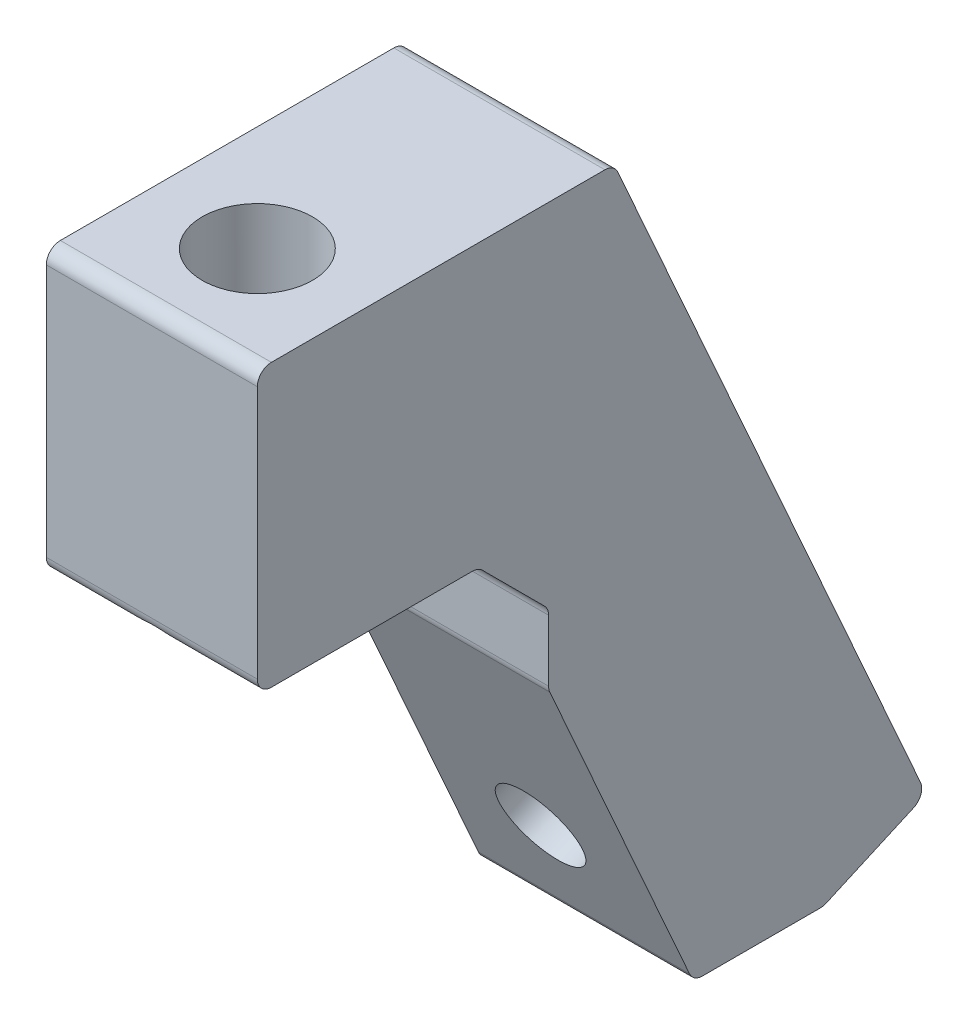
ISO-10303-21;
HEADER;
FILE_DESCRIPTION(('STEP AP214'),'2;1');
FILE_NAME('part.step','',(''),(''),'','','');
FILE_SCHEMA(('AUTOMOTIVE_DESIGN { 1 0 10303 214 1 1 1 1 }'));
ENDSEC;
DATA;
#1=APPLICATION_CONTEXT('core data for automotive mechanical design processes');
#2=APPLICATION_PROTOCOL_DEFINITION('international standard','automotive_design',2000,#1);
#3=PRODUCT_CONTEXT('',#1,'mechanical');
#4=PRODUCT('Part','Part','',(#3));
#5=PRODUCT_RELATED_PRODUCT_CATEGORY('part','',(#4));
#6=PRODUCT_DEFINITION_FORMATION('','',#4);
#7=PRODUCT_DEFINITION_CONTEXT('part definition',#1,'design');
#8=PRODUCT_DEFINITION('design','',#6,#7);
#9=PRODUCT_DEFINITION_SHAPE('','',#8);
#10=(LENGTH_UNIT() NAMED_UNIT(*) SI_UNIT(.MILLI.,.METRE.));
#11=(NAMED_UNIT(*) PLANE_ANGLE_UNIT() SI_UNIT($,.RADIAN.));
#12=(NAMED_UNIT(*) SI_UNIT($,.STERADIAN.) SOLID_ANGLE_UNIT());
#13=UNCERTAINTY_MEASURE_WITH_UNIT(LENGTH_MEASURE(1.E-05),#10,'distance_accuracy_value','');
#14=(GEOMETRIC_REPRESENTATION_CONTEXT(3) GLOBAL_UNCERTAINTY_ASSIGNED_CONTEXT((#13)) GLOBAL_UNIT_ASSIGNED_CONTEXT((#10,
#11,#12)) REPRESENTATION_CONTEXT('',''));
#15=CARTESIAN_POINT('',(0.,0.,0.));
#16=DIRECTION('',(0.,0.,1.));
#17=DIRECTION('',(1.,0.,0.));
#18=AXIS2_PLACEMENT_3D('',#15,#16,#17);
#19=CARTESIAN_POINT('',(0.,25.4,8.53468524857439));
#20=DIRECTION('',(0.,0.,-1.));
#21=DIRECTION('',(-1.,0.,0.));
#22=AXIS2_PLACEMENT_3D('',#19,#20,#21);
#23=PLANE('',#22);
#24=DIRECTION('',(0.,-1.,0.));
#25=VECTOR('',#24,1.);
#26=CARTESIAN_POINT('',(-9.52499999999998,25.4,8.53468524857439));
#27=LINE('',#26,#25);
#28=CARTESIAN_POINT('',(-9.52499999999999,21.9619743878931,8.53468524857445));
#29=VERTEX_POINT('',#28);
#30=CARTESIAN_POINT('',(-9.52499999999999,19.1849734166605,8.53468524857449));
#31=VERTEX_POINT('',#30);
#32=EDGE_CURVE('E230',#29,#31,#27,.T.);
#33=ORIENTED_EDGE('',*,*,#32,.T.);
#34=DIRECTION('',(-1.,0.,0.));
#35=VECTOR('',#34,1.);
#36=CARTESIAN_POINT('',(0.,19.1849734166604,8.5346852485745));
#37=LINE('',#36,#35);
#38=CARTESIAN_POINT('',(0.,19.1849734166604,8.53468524857449));
#39=VERTEX_POINT('',#38);
#40=EDGE_CURVE('E360',#31,#39,#37,.F.);
#41=ORIENTED_EDGE('',*,*,#40,.T.);
#42=DIRECTION('',(0.,-1.,0.));
#43=VECTOR('',#42,1.);
#44=CARTESIAN_POINT('',(0.,25.4,8.53468524857439));
#45=LINE('',#44,#43);
#46=CARTESIAN_POINT('',(0.,21.9619743878931,8.53468524857445));
#47=VERTEX_POINT('',#46);
#48=EDGE_CURVE('E213',#47,#39,#45,.T.);
#49=ORIENTED_EDGE('',*,*,#48,.F.);
#50=DIRECTION('',(1.,0.,0.));
#51=VECTOR('',#50,1.);
#52=CARTESIAN_POINT('',(-9.52499999999999,21.9619743878931,8.53468524857445));
#53=LINE('',#52,#51);
#54=EDGE_CURVE('E348',#47,#29,#53,.F.);
#55=ORIENTED_EDGE('',*,*,#54,.T.);
#56=EDGE_LOOP('',(#33,#41,#49,#55));
#57=FACE_BOUND('',#56,.T.);
#58=ADVANCED_FACE('F37',(#57),#23,.F.);
#59=CARTESIAN_POINT('',(0.,19.05,8.5346852485745));
#60=DIRECTION('',(0.,0.406736643075795,-0.913545457642603));
#61=DIRECTION('',(-1.,0.,0.));
#62=AXIS2_PLACEMENT_3D('',#59,#60,#61);
#63=PLANE('',#62);
#64=CARTESIAN_POINT('',(-4.76249851499107,9.16534594457646,4.13375371874866));
#65=DIRECTION('',(0.,0.406736643075795,-0.913545457642603));
#66=DIRECTION('',(-1.,0.,0.));
#67=AXIS2_PLACEMENT_3D('',#64,#65,#66);
#68=CIRCLE('',#67,1.89865);
#69=CARTESIAN_POINT('',(-6.66114851499107,9.16534594457646,4.13375371874866));
#70=VERTEX_POINT('',#69);
#71=EDGE_CURVE('E450',#70,#70,#68,.T.);
#72=ORIENTED_EDGE('',*,*,#71,.T.);
#73=EDGE_LOOP('',(#72));
#74=FACE_BOUND('',#73,.T.);
#75=DIRECTION('',(0.,-0.913545457642603,-0.406736643075795));
#76=VECTOR('',#75,1.);
#77=CARTESIAN_POINT('',(0.,19.05,8.5346852485745));
#78=LINE('',#77,#76);
#79=CARTESIAN_POINT('',(0.,18.9266956483073,8.47978661417755));
#80=VERTEX_POINT('',#79);
#81=CARTESIAN_POINT('',(0.,4.76386063782186,2.1740862022175));
#82=VERTEX_POINT('',#81);
#83=EDGE_CURVE('E217',#80,#82,#78,.T.);
#84=ORIENTED_EDGE('',*,*,#83,.F.);
#85=DIRECTION('',(-1.,0.,0.));
#86=VECTOR('',#85,1.);
#87=CARTESIAN_POINT('',(0.,18.9266956483073,8.47978661417755));
#88=LINE('',#87,#86);
#89=CARTESIAN_POINT('',(-9.52500000000001,18.9266956483073,8.47978661417754));
#90=VERTEX_POINT('',#89);
#91=EDGE_CURVE('E429',#80,#90,#88,.T.);
#92=ORIENTED_EDGE('',*,*,#91,.T.);
#93=DIRECTION('',(0.,-0.913545457642603,-0.406736643075795));
#94=VECTOR('',#93,1.);
#95=CARTESIAN_POINT('',(-9.52499999999999,19.05,8.53468524857449));
#96=LINE('',#95,#94);
#97=CARTESIAN_POINT('',(-9.52500000000001,4.76386063782186,2.1740862022175));
#98=VERTEX_POINT('',#97);
#99=EDGE_CURVE('E233',#90,#98,#96,.T.);
#100=ORIENTED_EDGE('',*,*,#99,.T.);
#101=DIRECTION('',(1.,0.,0.));
#102=VECTOR('',#101,1.);
#103=CARTESIAN_POINT('',(0.,4.76386063782186,2.17408620221749));
#104=LINE('',#103,#102);
#105=EDGE_CURVE('E426',#98,#82,#104,.T.);
#106=ORIENTED_EDGE('',*,*,#105,.T.);
#107=EDGE_LOOP('',(#84,#92,#100,#106));
#108=FACE_BOUND('',#107,.T.);
#109=ADVANCED_FACE('F301',(#74,#108),#63,.F.);
#110=CARTESIAN_POINT('',(0.,15.1548810370458,-4.63534205325857));
#111=DIRECTION('',(0.,-0.406736643075795,0.913545457642603));
#112=DIRECTION('',(1.,0.,0.));
#113=AXIS2_PLACEMENT_3D('',#110,#111,#112);
#114=PLANE('',#113);
#115=CARTESIAN_POINT('',(-4.76249851499108,13.4145769400276,-5.41017535784828));
#116=DIRECTION('',(0.,0.406736643075795,-0.913545457642603));
#117=DIRECTION('',(-1.,0.,0.));
#118=AXIS2_PLACEMENT_3D('',#115,#116,#117);
#119=CIRCLE('',#118,1.89865);
#120=CARTESIAN_POINT('',(-6.66114851499108,13.4145769400276,-5.41017535784827));
#121=VERTEX_POINT('',#120);
#122=EDGE_CURVE('E196',#121,#121,#119,.T.);
#123=ORIENTED_EDGE('',*,*,#122,.F.);
#124=EDGE_LOOP('',(#123));
#125=FACE_BOUND('',#124,.T.);
#126=CARTESIAN_POINT('',(-4.76249963170612,31.9778206393252,2.85471322945187));
#127=DIRECTION('',(0.,0.406736643075795,-0.913545457642603));
#128=DIRECTION('',(-1.,0.,0.));
#129=AXIS2_PLACEMENT_3D('',#126,#127,#128);
#130=CIRCLE('',#129,1.89865000000002);
#131=CARTESIAN_POINT('',(-6.66114963170614,31.9778206393252,2.85471322945187));
#132=VERTEX_POINT('',#131);
#133=EDGE_CURVE('E479',#132,#132,#130,.T.);
#134=ORIENTED_EDGE('',*,*,#133,.F.);
#135=EDGE_LOOP('',(#134));
#136=FACE_BOUND('',#135,.T.);
#137=DIRECTION('',(0.,0.913545457642603,0.406736643075795));
#138=VECTOR('',#137,1.);
#139=CARTESIAN_POINT('',(-9.52500000000001,15.1548810370458,-4.63534205325857));
#140=LINE('',#139,#138);
#141=CARTESIAN_POINT('',(-9.52499999999999,7.03346191860308,-8.25123081020238));
#142=VERTEX_POINT('',#141);
#143=CARTESIAN_POINT('',(-9.52499999999999,37.7232777683531,5.4127555529427));
#144=VERTEX_POINT('',#143);
#145=EDGE_CURVE('E236',#142,#144,#140,.T.);
#146=ORIENTED_EDGE('',*,*,#145,.T.);
#147=DIRECTION('',(-1.,0.,0.));
#148=VECTOR('',#147,1.);
#149=CARTESIAN_POINT('',(0.,37.7232777683531,5.4127555529427));
#150=LINE('',#149,#148);
#151=CARTESIAN_POINT('',(0.,37.7232777683531,5.41275555294271));
#152=VERTEX_POINT('',#151);
#153=EDGE_CURVE('E424',#144,#152,#150,.F.);
#154=ORIENTED_EDGE('',*,*,#153,.T.);
#155=DIRECTION('',(0.,0.913545457642603,0.406736643075795));
#156=VECTOR('',#155,1.);
#157=CARTESIAN_POINT('',(0.,15.1548810370458,-4.63534205325857));
#158=LINE('',#157,#156);
#159=CARTESIAN_POINT('',(0.,7.03346191860308,-8.25123081020238));
#160=VERTEX_POINT('',#159);
#161=EDGE_CURVE('E220',#160,#152,#158,.T.);
#162=ORIENTED_EDGE('',*,*,#161,.F.);
#163=DIRECTION('',(1.,0.,0.));
#164=VECTOR('',#163,1.);
#165=CARTESIAN_POINT('',(-9.52500000000002,7.03346191860308,-8.25123081020238));
#166=LINE('',#165,#164);
#167=EDGE_CURVE('E422',#160,#142,#166,.F.);
#168=ORIENTED_EDGE('',*,*,#167,.T.);
#169=EDGE_LOOP('',(#146,#154,#162,#168));
#170=FACE_BOUND('',#169,.T.);
#171=ADVANCED_FACE('F307',(#125,#136,#170),#114,.F.);
#172=CARTESIAN_POINT('',(0.,38.1,16.9166852485744));
#173=DIRECTION('',(0.,-1.,0.));
#174=DIRECTION('',(0.608761429008727,0.,-0.793353340291231));
#175=AXIS2_PLACEMENT_3D('',#172,#173,#174);
#176=PLANE('',#175);
#177=CARTESIAN_POINT('',(-4.76249999999993,38.1,16.9166852485744));
#178=DIRECTION('',(0.,-1.,0.));
#179=DIRECTION('',(0.608761429008727,0.,-0.793353340291231));
#180=AXIS2_PLACEMENT_3D('',#177,#178,#179);
#181=CIRCLE('',#180,2.4892);
#182=CARTESIAN_POINT('',(-3.24717105091141,38.1,14.9418701139215));
#183=VERTEX_POINT('',#182);
#184=EDGE_CURVE('E204',#183,#183,#181,.T.);
#185=ORIENTED_EDGE('',*,*,#184,.T.);
#186=EDGE_LOOP('',(#185));
#187=FACE_BOUND('',#186,.T.);
#188=DIRECTION('',(0.,0.,1.));
#189=VECTOR('',#188,1.);
#190=CARTESIAN_POINT('',(0.,38.1,8.53468524857451));
#191=LINE('',#190,#189);
#192=CARTESIAN_POINT('',(0.,38.1,5.99285691854575));
#193=VERTEX_POINT('',#192);
#194=CARTESIAN_POINT('',(0.,38.1,21.0441852485744));
#195=VERTEX_POINT('',#194);
#196=EDGE_CURVE('E223',#193,#195,#191,.T.);
#197=ORIENTED_EDGE('',*,*,#196,.F.);
#198=DIRECTION('',(-1.,0.,0.));
#199=VECTOR('',#198,1.);
#200=CARTESIAN_POINT('',(0.,38.1,5.99285691854575));
#201=LINE('',#200,#199);
#202=CARTESIAN_POINT('',(-9.52499999999999,38.1,5.99285691854575));
#203=VERTEX_POINT('',#202);
#204=EDGE_CURVE('E419',#193,#203,#201,.T.);
#205=ORIENTED_EDGE('',*,*,#204,.T.);
#206=DIRECTION('',(0.,0.,1.));
#207=VECTOR('',#206,1.);
#208=CARTESIAN_POINT('',(-9.52499999999998,38.1,16.9166852485744));
#209=LINE('',#208,#207);
#210=CARTESIAN_POINT('',(-9.52499999999999,38.1,21.0441852485744));
#211=VERTEX_POINT('',#210);
#212=EDGE_CURVE('E239',#203,#211,#209,.T.);
#213=ORIENTED_EDGE('',*,*,#212,.T.);
#214=DIRECTION('',(-1.,0.,0.));
#215=VECTOR('',#214,1.);
#216=CARTESIAN_POINT('',(0.,38.1,21.0441852485744));
#217=LINE('',#216,#215);
#218=EDGE_CURVE('E417',#211,#195,#217,.F.);
#219=ORIENTED_EDGE('',*,*,#218,.T.);
#220=EDGE_LOOP('',(#197,#205,#213,#219));
#221=FACE_BOUND('',#220,.T.);
#222=ADVANCED_FACE('F473',(#187,#221),#176,.F.);
#223=CARTESIAN_POINT('',(0.,38.1,21.6791852485744));
#224=DIRECTION('',(0.,0.,-1.));
#225=DIRECTION('',(-1.,0.,0.));
#226=AXIS2_PLACEMENT_3D('',#223,#224,#225);
#227=PLANE('',#226);
#228=DIRECTION('',(0.,-1.,0.));
#229=VECTOR('',#228,1.);
#230=CARTESIAN_POINT('',(-9.52499999999998,38.1,21.6791852485744));
#231=LINE('',#230,#229);
#232=CARTESIAN_POINT('',(-9.52499999999998,37.465,21.6791852485744));
#233=VERTEX_POINT('',#232);
#234=CARTESIAN_POINT('',(-9.52499999999999,26.035,21.6791852485744));
#235=VERTEX_POINT('',#234);
#236=EDGE_CURVE('E242',#233,#235,#231,.T.);
#237=ORIENTED_EDGE('',*,*,#236,.T.);
#238=DIRECTION('',(-1.,0.,0.));
#239=VECTOR('',#238,1.);
#240=CARTESIAN_POINT('',(0.,26.035,21.6791852485744));
#241=LINE('',#240,#239);
#242=CARTESIAN_POINT('',(0.,26.035,21.6791852485744));
#243=VERTEX_POINT('',#242);
#244=EDGE_CURVE('E282',#235,#243,#241,.F.);
#245=ORIENTED_EDGE('',*,*,#244,.T.);
#246=DIRECTION('',(0.,-1.,0.));
#247=VECTOR('',#246,1.);
#248=CARTESIAN_POINT('',(0.,38.1,21.6791852485744));
#249=LINE('',#248,#247);
#250=CARTESIAN_POINT('',(0.,37.465,21.6791852485744));
#251=VERTEX_POINT('',#250);
#252=EDGE_CURVE('E226',#251,#243,#249,.T.);
#253=ORIENTED_EDGE('',*,*,#252,.F.);
#254=DIRECTION('',(-1.,0.,0.));
#255=VECTOR('',#254,1.);
#256=CARTESIAN_POINT('',(0.,37.465,21.6791852485744));
#257=LINE('',#256,#255);
#258=EDGE_CURVE('E372',#251,#233,#257,.T.);
#259=ORIENTED_EDGE('',*,*,#258,.T.);
#260=EDGE_LOOP('',(#237,#245,#253,#259));
#261=FACE_BOUND('',#260,.T.);
#262=ADVANCED_FACE('F378',(#261),#227,.F.);
#263=CARTESIAN_POINT('',(0.,25.4,21.6791852485744));
#264=DIRECTION('',(0.,1.,0.));
#265=DIRECTION('',(-0.608761429008727,0.,0.793353340291231));
#266=AXIS2_PLACEMENT_3D('',#263,#264,#265);
#267=PLANE('',#266);
#268=DIRECTION('',(0.,0.,-1.));
#269=VECTOR('',#268,1.);
#270=CARTESIAN_POINT('',(-9.52499999999999,25.4,21.6791852485744));
#271=LINE('',#270,#269);
#272=CARTESIAN_POINT('',(-9.52499999999999,25.4,21.0441852485744));
#273=VERTEX_POINT('',#272);
#274=CARTESIAN_POINT('',(-9.52499999999998,25.4,11.9727108606813));
#275=VERTEX_POINT('',#274);
#276=EDGE_CURVE('E214',#273,#275,#271,.T.);
#277=ORIENTED_EDGE('',*,*,#276,.T.);
#278=DIRECTION('',(-1.,0.,0.));
#279=VECTOR('',#278,1.);
#280=CARTESIAN_POINT('',(0.,25.4,11.9727108606813));
#281=LINE('',#280,#279);
#282=CARTESIAN_POINT('',(0.,25.4,11.9727108606813));
#283=VERTEX_POINT('',#282);
#284=EDGE_CURVE('E370',#275,#283,#281,.F.);
#285=ORIENTED_EDGE('',*,*,#284,.T.);
#286=DIRECTION('',(0.,0.,-1.));
#287=VECTOR('',#286,1.);
#288=CARTESIAN_POINT('',(0.,25.4,16.9166852485744));
#289=LINE('',#288,#287);
#290=CARTESIAN_POINT('',(0.,25.4,21.0441852485744));
#291=VERTEX_POINT('',#290);
#292=EDGE_CURVE('E210',#291,#283,#289,.T.);
#293=ORIENTED_EDGE('',*,*,#292,.F.);
#294=DIRECTION('',(-1.,0.,0.));
#295=VECTOR('',#294,1.);
#296=CARTESIAN_POINT('',(0.,25.4,21.0441852485744));
#297=LINE('',#296,#295);
#298=CARTESIAN_POINT('',(-3.46826922278375,25.4,21.0441852485744));
#299=VERTEX_POINT('',#298);
#300=EDGE_CURVE('E52',#291,#299,#297,.T.);
#301=ORIENTED_EDGE('',*,*,#300,.T.);
#302=CARTESIAN_POINT('',(-4.76249963170611,25.4,17.6287402775227));
#303=DIRECTION('',(0.,1.,0.));
#304=DIRECTION('',(0.,0.,-1.));
#305=AXIS2_PLACEMENT_3D('',#302,#303,#304);
#306=ELLIPSE('',#305,4.66800823658813,1.89865000000002);
#307=CARTESIAN_POINT('',(-2.90297072716722,25.4,18.5714563878799));
#308=VERTEX_POINT('',#307);
#309=EDGE_CURVE('E195',#299,#308,#306,.T.);
#310=ORIENTED_EDGE('',*,*,#309,.T.);
#311=CARTESIAN_POINT('',(-4.76249999999995,25.4,16.9166852485744));
#312=DIRECTION('',(0.,-1.,0.));
#313=DIRECTION('',(0.608761429008727,0.,-0.793353340291231));
#314=AXIS2_PLACEMENT_3D('',#311,#312,#313);
#315=CIRCLE('',#314,2.4892);
#316=CARTESIAN_POINT('',(-3.19921039069226,25.4,14.9796147187716));
#317=VERTEX_POINT('',#316);
#318=EDGE_CURVE('E194',#317,#308,#315,.T.);
#319=ORIENTED_EDGE('',*,*,#318,.F.);
#320=CARTESIAN_POINT('',(-6.32578865733964,25.4,14.9796139504976));
#321=VERTEX_POINT('',#320);
#322=EDGE_CURVE('E182',#317,#321,#306,.T.);
#323=ORIENTED_EDGE('',*,*,#322,.T.);
#324=CARTESIAN_POINT('',(-6.62202845959989,25.4,18.57145730174));
#325=VERTEX_POINT('',#324);
#326=EDGE_CURVE('E193',#325,#321,#315,.T.);
#327=ORIENTED_EDGE('',*,*,#326,.F.);
#328=CARTESIAN_POINT('',(-6.05673004062848,25.4,21.0441852485744));
#329=VERTEX_POINT('',#328);
#330=EDGE_CURVE('E198',#325,#329,#306,.T.);
#331=ORIENTED_EDGE('',*,*,#330,.T.);
#332=DIRECTION('',(-1.,0.,0.));
#333=VECTOR('',#332,1.);
#334=CARTESIAN_POINT('',(0.,25.4,21.0441852485744));
#335=LINE('',#334,#333);
#336=EDGE_CURVE('E367',#329,#273,#335,.T.);
#337=ORIENTED_EDGE('',*,*,#336,.T.);
#338=EDGE_LOOP('',(#277,#285,#293,#301,#310,#319,#323,#327,#331,#337));
#339=FACE_BOUND('',#338,.T.);
#340=ADVANCED_FACE('F192',(#339),#267,.F.);
#341=CARTESIAN_POINT('',(0.,0.,43.4596852485536));
#342=DIRECTION('',(-1.,0.,0.));
#343=DIRECTION('',(0.,0.,1.));
#344=AXIS2_PLACEMENT_3D('',#341,#342,#343);
#345=PLANE('',#344);
#346=DIRECTION('',(0.,0.,1.));
#347=VECTOR('',#346,1.);
#348=CARTESIAN_POINT('',(0.,4.38713840617499,2.00635865829485));
#349=LINE('',#348,#347);
#350=CARTESIAN_POINT('',(0.,4.38713840617499,-3.73372423707064));
#351=VERTEX_POINT('',#350);
#352=CARTESIAN_POINT('',(0.,4.38713840617499,1.59398483661444));
#353=VERTEX_POINT('',#352);
#354=EDGE_CURVE('E445',#351,#353,#349,.T.);
#355=ORIENTED_EDGE('',*,*,#354,.F.);
#356=CARTESIAN_POINT('',(0.,5.02213840617499,-3.73372423707063));
#357=DIRECTION('',(-1.,0.,0.));
#358=DIRECTION('',(0.,0.,1.));
#359=AXIS2_PLACEMENT_3D('',#356,#357,#358);
#360=CIRCLE('',#359,0.635);
#361=CARTESIAN_POINT('',(0.,4.44203704057194,-3.99200200542375));
#362=VERTEX_POINT('',#361);
#363=EDGE_CURVE('E396',#351,#362,#360,.F.);
#364=ORIENTED_EDGE('',*,*,#363,.T.);
#365=DIRECTION('',(0.,0.406736643075796,-0.913545457642603));
#366=VECTOR('',#365,1.);
#367=CARTESIAN_POINT('',(0.,6.45336055300003,-8.50950857855549));
#368=LINE('',#367,#366);
#369=CARTESIAN_POINT('',(0.,6.1950827846469,-7.92940721295245));
#370=VERTEX_POINT('',#369);
#371=EDGE_CURVE('E206',#362,#370,#368,.T.);
#372=ORIENTED_EDGE('',*,*,#371,.T.);
#373=CARTESIAN_POINT('',(0.,6.77518415024995,-7.67112944459932));
#374=DIRECTION('',(-1.,0.,0.));
#375=DIRECTION('',(0.,0.,1.));
#376=AXIS2_PLACEMENT_3D('',#373,#374,#375);
#377=CIRCLE('',#376,0.635);
#378=EDGE_CURVE('E387',#370,#160,#377,.F.);
#379=ORIENTED_EDGE('',*,*,#378,.T.);
#380=ORIENTED_EDGE('',*,*,#161,.T.);
#381=CARTESIAN_POINT('',(0.,37.465,5.99285691854576));
#382=DIRECTION('',(-1.,0.,0.));
#383=DIRECTION('',(0.,0.,1.));
#384=AXIS2_PLACEMENT_3D('',#381,#382,#383);
#385=CIRCLE('',#384,0.635);
#386=EDGE_CURVE('E394',#152,#193,#385,.F.);
#387=ORIENTED_EDGE('',*,*,#386,.T.);
#388=ORIENTED_EDGE('',*,*,#196,.T.);
#389=CARTESIAN_POINT('',(0.,37.465,21.0441852485744));
#390=DIRECTION('',(-1.,0.,0.));
#391=DIRECTION('',(0.,0.,1.));
#392=AXIS2_PLACEMENT_3D('',#389,#390,#391);
#393=CIRCLE('',#392,0.635);
#394=EDGE_CURVE('E384',#195,#251,#393,.F.);
#395=ORIENTED_EDGE('',*,*,#394,.T.);
#396=ORIENTED_EDGE('',*,*,#252,.T.);
#397=CARTESIAN_POINT('',(0.,26.035,21.0441852485744));
#398=DIRECTION('',(-1.,0.,0.));
#399=DIRECTION('',(0.,0.,1.));
#400=AXIS2_PLACEMENT_3D('',#397,#398,#399);
#401=CIRCLE('',#400,0.635);
#402=EDGE_CURVE('E383',#243,#291,#401,.F.);
#403=ORIENTED_EDGE('',*,*,#402,.T.);
#404=ORIENTED_EDGE('',*,*,#292,.T.);
#405=CARTESIAN_POINT('',(0.,24.765,11.9727108606813));
#406=DIRECTION('',(-1.,0.,0.));
#407=DIRECTION('',(0.,0.,1.));
#408=AXIS2_PLACEMENT_3D('',#405,#406,#407);
#409=CIRCLE('',#408,0.635);
#410=CARTESIAN_POINT('',(0.,25.2140128060535,11.5236980546278));
#411=VERTEX_POINT('',#410);
#412=EDGE_CURVE('E45',#283,#411,#409,.T.);
#413=ORIENTED_EDGE('',*,*,#412,.T.);
#414=DIRECTION('',(0.,0.707106781186551,0.707106781186544));
#415=VECTOR('',#414,1.);
#416=CARTESIAN_POINT('',(0.,28.5749999999895,14.8846852485638));
#417=LINE('',#416,#415);
#418=CARTESIAN_POINT('',(0.,22.4109871939466,8.72067244252098));
#419=VERTEX_POINT('',#418);
#420=EDGE_CURVE('E188',#411,#419,#417,.F.);
#421=ORIENTED_EDGE('',*,*,#420,.T.);
#422=CARTESIAN_POINT('',(0.,21.9619743878931,9.16968524857446));
#423=DIRECTION('',(-1.,0.,0.));
#424=DIRECTION('',(0.,0.,1.));
#425=AXIS2_PLACEMENT_3D('',#422,#423,#424);
#426=CIRCLE('',#425,0.635);
#427=EDGE_CURVE('E345',#419,#47,#426,.T.);
#428=ORIENTED_EDGE('',*,*,#427,.T.);
#429=ORIENTED_EDGE('',*,*,#48,.T.);
#430=CARTESIAN_POINT('',(0.,19.1849734166604,7.89968524857449));
#431=DIRECTION('',(-1.,0.,0.));
#432=DIRECTION('',(0.,0.,1.));
#433=AXIS2_PLACEMENT_3D('',#430,#431,#432);
#434=CIRCLE('',#433,0.635);
#435=EDGE_CURVE('E385',#39,#80,#434,.F.);
#436=ORIENTED_EDGE('',*,*,#435,.T.);
#437=ORIENTED_EDGE('',*,*,#83,.T.);
#438=CARTESIAN_POINT('',(0.,5.02213840617499,1.59398483661445));
#439=DIRECTION('',(-1.,0.,0.));
#440=DIRECTION('',(0.,0.,1.));
#441=AXIS2_PLACEMENT_3D('',#438,#439,#440);
#442=CIRCLE('',#441,0.635);
#443=EDGE_CURVE('E389',#82,#353,#442,.F.);
#444=ORIENTED_EDGE('',*,*,#443,.T.);
#445=EDGE_LOOP('',(#355,#364,#372,#379,#380,#387,#388,#395,#396,#403,#404,#413,#421,#428,#429,
#436,#437,#444));
#446=FACE_BOUND('',#445,.T.);
#447=ADVANCED_FACE('F382',(#446),#345,.F.);
#448=CARTESIAN_POINT('',(-9.52500000000001,0.,43.4596852485536));
#449=DIRECTION('',(-1.,0.,0.));
#450=DIRECTION('',(0.,0.,1.));
#451=AXIS2_PLACEMENT_3D('',#448,#449,#450);
#452=PLANE('',#451);
#453=DIRECTION('',(0.,0.406736643075796,-0.913545457642603));
#454=VECTOR('',#453,1.);
#455=CARTESIAN_POINT('',(-9.52500000000001,6.45336055300002,-8.50950857855549));
#456=LINE('',#455,#454);
#457=CARTESIAN_POINT('',(-9.52500000000001,4.44203704057193,-3.99200200542375));
#458=VERTEX_POINT('',#457);
#459=CARTESIAN_POINT('',(-9.52500000000001,6.1950827846469,-7.92940721295245));
#460=VERTEX_POINT('',#459);
#461=EDGE_CURVE('E202',#458,#460,#456,.T.);
#462=ORIENTED_EDGE('',*,*,#461,.F.);
#463=CARTESIAN_POINT('',(-9.52500000000002,5.02213840617499,-3.73372423707061));
#464=DIRECTION('',(-1.,0.,0.));
#465=DIRECTION('',(0.,0.,1.));
#466=AXIS2_PLACEMENT_3D('',#463,#464,#465);
#467=CIRCLE('',#466,0.635);
#468=CARTESIAN_POINT('',(-9.52500000000001,4.38713840617498,-3.73372423707063));
#469=VERTEX_POINT('',#468);
#470=EDGE_CURVE('E415',#458,#469,#467,.T.);
#471=ORIENTED_EDGE('',*,*,#470,.T.);
#472=DIRECTION('',(0.,0.,-1.));
#473=VECTOR('',#472,1.);
#474=CARTESIAN_POINT('',(-9.52500000000001,4.38713840617499,43.4596852485536));
#475=LINE('',#474,#473);
#476=CARTESIAN_POINT('',(-9.52500000000001,4.38713840617499,1.59398483661444));
#477=VERTEX_POINT('',#476);
#478=EDGE_CURVE('E441',#477,#469,#475,.T.);
#479=ORIENTED_EDGE('',*,*,#478,.F.);
#480=CARTESIAN_POINT('',(-9.52500000000001,5.02213840617499,1.59398483661444));
#481=DIRECTION('',(-1.,0.,0.));
#482=DIRECTION('',(0.,0.,1.));
#483=AXIS2_PLACEMENT_3D('',#480,#481,#482);
#484=CIRCLE('',#483,0.635);
#485=EDGE_CURVE('E403',#477,#98,#484,.T.);
#486=ORIENTED_EDGE('',*,*,#485,.T.);
#487=ORIENTED_EDGE('',*,*,#99,.F.);
#488=CARTESIAN_POINT('',(-9.52500000000001,19.1849734166604,7.8996852485745));
#489=DIRECTION('',(-1.,0.,0.));
#490=DIRECTION('',(0.,0.,1.));
#491=AXIS2_PLACEMENT_3D('',#488,#489,#490);
#492=CIRCLE('',#491,0.635);
#493=EDGE_CURVE('E409',#90,#31,#492,.T.);
#494=ORIENTED_EDGE('',*,*,#493,.T.);
#495=ORIENTED_EDGE('',*,*,#32,.F.);
#496=CARTESIAN_POINT('',(-9.52500000000001,21.9619743878931,9.16968524857446));
#497=DIRECTION('',(-1.,0.,0.));
#498=DIRECTION('',(0.,0.,1.));
#499=AXIS2_PLACEMENT_3D('',#496,#497,#498);
#500=CIRCLE('',#499,0.635);
#501=CARTESIAN_POINT('',(-9.52500000000001,22.4109871939466,8.72067244252099));
#502=VERTEX_POINT('',#501);
#503=EDGE_CURVE('E281',#29,#502,#500,.F.);
#504=ORIENTED_EDGE('',*,*,#503,.T.);
#505=DIRECTION('',(0.,-0.707106781186551,-0.707106781186544));
#506=VECTOR('',#505,1.);
#507=CARTESIAN_POINT('',(-9.52500000000001,22.225,8.53468524857443));
#508=LINE('',#507,#506);
#509=CARTESIAN_POINT('',(-9.52500000000001,25.2140128060535,11.5236980546278));
#510=VERTEX_POINT('',#509);
#511=EDGE_CURVE('E229',#502,#510,#508,.F.);
#512=ORIENTED_EDGE('',*,*,#511,.T.);
#513=CARTESIAN_POINT('',(-9.52500000000001,24.765,11.9727108606813));
#514=DIRECTION('',(-1.,0.,0.));
#515=DIRECTION('',(0.,0.,1.));
#516=AXIS2_PLACEMENT_3D('',#513,#514,#515);
#517=CIRCLE('',#516,0.635);
#518=EDGE_CURVE('E11',#510,#275,#517,.F.);
#519=ORIENTED_EDGE('',*,*,#518,.T.);
#520=ORIENTED_EDGE('',*,*,#276,.F.);
#521=CARTESIAN_POINT('',(-9.52500000000001,26.035,21.0441852485744));
#522=DIRECTION('',(-1.,0.,0.));
#523=DIRECTION('',(0.,0.,1.));
#524=AXIS2_PLACEMENT_3D('',#521,#522,#523);
#525=CIRCLE('',#524,0.635);
#526=EDGE_CURVE('E407',#273,#235,#525,.T.);
#527=ORIENTED_EDGE('',*,*,#526,.T.);
#528=ORIENTED_EDGE('',*,*,#236,.F.);
#529=CARTESIAN_POINT('',(-9.52500000000001,37.465,21.0441852485744));
#530=DIRECTION('',(-1.,0.,0.));
#531=DIRECTION('',(0.,0.,1.));
#532=AXIS2_PLACEMENT_3D('',#529,#530,#531);
#533=CIRCLE('',#532,0.635);
#534=EDGE_CURVE('E405',#233,#211,#533,.T.);
#535=ORIENTED_EDGE('',*,*,#534,.T.);
#536=ORIENTED_EDGE('',*,*,#212,.F.);
#537=CARTESIAN_POINT('',(-9.52500000000002,37.465,5.99285691854576));
#538=DIRECTION('',(-1.,0.,0.));
#539=DIRECTION('',(0.,0.,1.));
#540=AXIS2_PLACEMENT_3D('',#537,#538,#539);
#541=CIRCLE('',#540,0.635);
#542=EDGE_CURVE('E413',#203,#144,#541,.T.);
#543=ORIENTED_EDGE('',*,*,#542,.T.);
#544=ORIENTED_EDGE('',*,*,#145,.F.);
#545=CARTESIAN_POINT('',(-9.52500000000002,6.77518415024995,-7.67112944459934));
#546=DIRECTION('',(-1.,0.,0.));
#547=DIRECTION('',(0.,0.,1.));
#548=AXIS2_PLACEMENT_3D('',#545,#546,#547);
#549=CIRCLE('',#548,0.635);
#550=EDGE_CURVE('E411',#142,#460,#549,.T.);
#551=ORIENTED_EDGE('',*,*,#550,.T.);
#552=EDGE_LOOP('',(#462,#471,#479,#486,#487,#494,#495,#504,#512,#519,#520,#527,#528,#535,#536,
#543,#544,#551));
#553=FACE_BOUND('',#552,.T.);
#554=ADVANCED_FACE('F355',(#553),#452,.T.);
#555=CARTESIAN_POINT('',(-4.76249999999993,38.1,16.9166852485744));
#556=DIRECTION('',(0.,-1.,0.));
#557=DIRECTION('',(0.608761429008727,0.,-0.793353340291231));
#558=AXIS2_PLACEMENT_3D('',#555,#556,#557);
#559=CYLINDRICAL_SURFACE('',#558,2.4892);
#560=ORIENTED_EDGE('',*,*,#184,.F.);
#561=EDGE_LOOP('',(#560));
#562=FACE_BOUND('',#561,.T.);
#563=ORIENTED_EDGE('',*,*,#318,.T.);
#564=CARTESIAN_POINT('',(-2.90297072716722,25.4,18.5714563878799));
#565=CARTESIAN_POINT('',(-2.91183550241418,25.4427133390571,18.5814099343878));
#566=CARTESIAN_POINT('',(-2.92228966683364,25.484685544502,18.5930051918981));
#567=CARTESIAN_POINT('',(-2.94627443720384,25.5667711277828,18.618966062194));
#568=CARTESIAN_POINT('',(-2.95979944627752,25.6068877294503,18.6333266278247));
#569=CARTESIAN_POINT('',(-2.98970547203664,25.6846502095399,18.6641890198344));
#570=CARTESIAN_POINT('',(-3.00605647967898,25.7223168349662,18.680667922617));
#571=CARTESIAN_POINT('',(-3.04156405268634,25.795485003627,18.7153278154536));
#572=CARTESIAN_POINT('',(-3.06072179075997,25.8309856330396,18.7335095158196));
#573=CARTESIAN_POINT('',(-3.1219047037194,25.9336736696117,18.7895404933945));
#574=CARTESIAN_POINT('',(-3.16786309461553,25.9976189444967,18.8291177666587));
#575=CARTESIAN_POINT('',(-3.26922918569056,26.1170025848197,18.9092869938272));
#576=CARTESIAN_POINT('',(-3.32466398793531,26.1724156596941,18.9498815647745));
#577=CARTESIAN_POINT('',(-3.45267679005048,26.2823929199197,19.0349876081571));
#578=CARTESIAN_POINT('',(-3.5265759568447,26.335653605624,19.0792063907635));
#579=CARTESIAN_POINT('',(-3.68396772153065,26.4313125910819,19.1618572113732));
#580=CARTESIAN_POINT('',(-3.76745830111136,26.4737131700738,19.2002904629014));
#581=CARTESIAN_POINT('',(-3.95034935340536,26.5507699731493,19.2718936339631));
#582=CARTESIAN_POINT('',(-4.05050564192621,26.5843822076851,19.3042757293812));
#583=CARTESIAN_POINT('',(-4.25756373519811,26.6378177844217,19.3564694605107));
#584=CARTESIAN_POINT('',(-4.36446395323593,26.6576443570164,19.376284041072));
#585=CARTESIAN_POINT('',(-4.5754620818106,26.6822752934362,19.400991035236));
#586=CARTESIAN_POINT('',(-4.67937719091656,26.6878649547507,19.4066631335284));
#587=CARTESIAN_POINT('',(-4.88697812113452,26.6861555030254,19.4049355927043));
#588=CARTESIAN_POINT('',(-4.99066398713283,26.6788591882709,19.397538791596));
#589=CARTESIAN_POINT('',(-5.19063771638817,26.6521242442502,19.370783585364));
#590=CARTESIAN_POINT('',(-5.28705630922278,26.6331718256826,19.3519044748195));
#591=CARTESIAN_POINT('',(-5.47426481158536,26.583977596296,19.3039111124729));
#592=CARTESIAN_POINT('',(-5.5650550895563,26.5537365253713,19.2747975314778));
#593=CARTESIAN_POINT('',(-5.7421619965694,26.4811023408652,19.2070329559275));
#594=CARTESIAN_POINT('',(-5.82819373011533,26.438305382758,19.1680721973536));
#595=CARTESIAN_POINT('',(-5.99036940174415,26.3412604774044,19.0838992948666));
#596=CARTESIAN_POINT('',(-6.06649549305999,26.2869923119151,19.038676162577));
#597=CARTESIAN_POINT('',(-6.21176858814368,26.1630040963909,18.9424686534383));
#598=CARTESIAN_POINT('',(-6.28013468478941,26.0925061638437,18.8913009077066));
#599=CARTESIAN_POINT('',(-6.40149684820858,25.9380306304288,18.7917636329558));
#600=CARTESIAN_POINT('',(-6.45456586498452,25.8541200772405,18.7433817340662));
#601=CARTESIAN_POINT('',(-6.52625042104627,25.7077492386947,18.6736089064498));
#602=CARTESIAN_POINT('',(-6.55026397123191,25.6494710886174,18.6489985381929));
#603=CARTESIAN_POINT('',(-6.5811022726234,25.5585277563796,18.6163991363508));
#604=CARTESIAN_POINT('',(-6.59054121903463,25.5275139962635,18.6062248478557));
#605=CARTESIAN_POINT('',(-6.60763349173108,25.4644745790812,18.5875405830342));
#606=CARTESIAN_POINT('',(-6.61528507238102,25.432447967175,18.5790322350537));
#607=CARTESIAN_POINT('',(-6.62202845959989,25.4,18.57145730174));
#608=B_SPLINE_CURVE_WITH_KNOTS('',3,(#564,#565,#566,#567,#568,#569,#570,#571,#572,#573,#574,
#575,#576,#577,#578,#579,#580,#581,#582,#583,#584,#585,#586,#587,#588,#589,#590,#591,#592,#593,
#594,#595,#596,#597,#598,#599,#600,#601,#602,#603,#604,#605,#606,#607),.UNSPECIFIED.,.F.,.F.,(4,
2,2,2,2,2,2,2,2,2,2,2,2,2,2,2,2,2,2,2,2,4),(0.,0.134130955722736,0.268019381248855,
0.400564792043437,0.533165741763883,0.796413321238319,1.06042677215396,1.36296101216985,
1.66543170643064,1.99519460819896,2.32488021056707,2.63594285619965,2.94693796057896,
3.24576602496818,3.54457450665387,3.85430703800693,4.16459010048485,4.49514499113081,
4.82409638714712,5.02637980268537,5.12821707029701,5.23015338553367),.UNSPECIFIED.);
#609=EDGE_CURVE('E187',#308,#325,#608,.T.);
#610=ORIENTED_EDGE('',*,*,#609,.T.);
#611=ORIENTED_EDGE('',*,*,#326,.T.);
#612=CARTESIAN_POINT('',(-6.32578865733964,25.4,14.9796139504976));
#613=CARTESIAN_POINT('',(-6.3485786924851,25.4280099429769,14.9980026217162));
#614=CARTESIAN_POINT('',(-6.37035496519507,25.4569289175935,15.0162454532531));
#615=CARTESIAN_POINT('',(-6.41180148979467,25.5166610327573,15.0521020181091));
#616=CARTESIAN_POINT('',(-6.4314694897262,25.5474761444608,15.0697150656043));
#617=CARTESIAN_POINT('',(-6.48728559946649,25.643065456645,15.1211930819846));
#618=CARTESIAN_POINT('',(-6.52004492669525,25.7107398849103,15.1535300528742));
#619=CARTESIAN_POINT('',(-6.57573376161534,25.8536485246852,15.2108338848086));
#620=CARTESIAN_POINT('',(-6.59858946958245,25.9289345050677,15.2357449953904));
#621=CARTESIAN_POINT('',(-6.633586954112,26.084329078665,15.2747789271836));
#622=CARTESIAN_POINT('',(-6.64577164503685,26.1644169581265,15.2889449296332));
#623=CARTESIAN_POINT('',(-6.65947212828433,26.3183414623821,15.3049461270512));
#624=CARTESIAN_POINT('',(-6.66194296319797,26.391990330358,15.3078842796471));
#625=CARTESIAN_POINT('',(-6.65991388465695,26.5391463331041,15.3054948176846));
#626=CARTESIAN_POINT('',(-6.65539839406496,26.6126527842078,15.3001487320424));
#627=CARTESIAN_POINT('',(-6.64156890079202,26.7474346683955,15.2841089191536));
#628=CARTESIAN_POINT('',(-6.63306188506761,26.8089134602477,15.2743213712788));
#629=CARTESIAN_POINT('',(-6.6122924804157,26.9305277939059,15.250963583278));
#630=CARTESIAN_POINT('',(-6.60002747757846,26.9906623693906,15.2373907108192));
#631=CARTESIAN_POINT('',(-6.5720784910702,27.1095964997024,15.2073097502066));
#632=CARTESIAN_POINT('',(-6.55638282541464,27.1683907159011,15.1907916694263));
#633=CARTESIAN_POINT('',(-6.52183389796012,27.2843863580349,15.1555862151629));
#634=CARTESIAN_POINT('',(-6.50297969784623,27.341587304746,15.1368981975583));
#635=CARTESIAN_POINT('',(-6.45306432581712,27.4797681133223,15.0891791392075));
#636=CARTESIAN_POINT('',(-6.42033079193911,27.559849025309,15.0592818670594));
#637=CARTESIAN_POINT('',(-6.34854688588767,27.7164281027425,14.9976188245692));
#638=CARTESIAN_POINT('',(-6.30949270483349,27.7929240717995,14.9658519349695));
#639=CARTESIAN_POINT('',(-6.2249551386972,27.9417312388146,14.9017033566777));
#640=CARTESIAN_POINT('',(-6.17948844813511,28.0140526369106,14.8693234476914));
#641=CARTESIAN_POINT('',(-6.08165773953754,28.153984354488,14.804964145216));
#642=CARTESIAN_POINT('',(-6.02929985892262,28.2215987851032,14.7729844227458));
#643=CARTESIAN_POINT('',(-5.91155878486974,28.357471862252,14.7074405681985));
#644=CARTESIAN_POINT('',(-5.84540162703692,28.425142768186,14.6740288563135));
#645=CARTESIAN_POINT('',(-5.70327616049628,28.5512613809552,14.610803984529));
#646=CARTESIAN_POINT('',(-5.62732214777084,28.6097222566231,14.5809857012328));
#647=CARTESIAN_POINT('',(-5.48157752185283,28.7035542477647,14.5326363121026));
#648=CARTESIAN_POINT('',(-5.41362556451154,28.7412043696577,14.5130414307391));
#649=CARTESIAN_POINT('',(-5.27171591660801,28.8061779374003,14.4790405731723));
#650=CARTESIAN_POINT('',(-5.19776665630211,28.833515583715,14.464627462871));
#651=CARTESIAN_POINT('',(-5.05725181397689,28.87225998717,14.4441432313479));
#652=CARTESIAN_POINT('',(-4.99133126109397,28.8854853765205,14.43712219136));
#653=CARTESIAN_POINT('',(-4.85790723508872,28.9018714503479,14.4284181989532));
#654=CARTESIAN_POINT('',(-4.79040475893073,28.9050383107726,14.4267319709563));
#655=CARTESIAN_POINT('',(-4.65578639159041,28.9010321551204,14.4288623433895));
#656=CARTESIAN_POINT('',(-4.58867059600139,28.8938566838405,14.4326802504659));
#657=CARTESIAN_POINT('',(-4.45671152445132,28.8697879368491,14.4454472386371));
#658=CARTESIAN_POINT('',(-4.39187000405076,28.8528873219454,14.4544001949397));
#659=CARTESIAN_POINT('',(-4.2490332258049,28.8049540589382,14.4796714275627));
#660=CARTESIAN_POINT('',(-4.17214013277935,28.7713549588205,14.4973169985767));
#661=CARTESIAN_POINT('',(-4.02553515704868,28.6934534293225,14.5378584450173));
#662=CARTESIAN_POINT('',(-3.9558356636732,28.6491329596485,14.5607631664069));
#663=CARTESIAN_POINT('',(-3.79266802322823,28.5295112197311,14.6218395101352));
#664=CARTESIAN_POINT('',(-3.70350177024852,28.4494590352132,14.6621153976787));
#665=CARTESIAN_POINT('',(-3.53978818763307,28.2772073760016,14.7465216626849));
#666=CARTESIAN_POINT('',(-3.46528890551203,28.1849695787148,14.7906640458558));
#667=CARTESIAN_POINT('',(-3.34835933743808,28.0184055035177,14.8673556454117));
#668=CARTESIAN_POINT('',(-3.30275842241787,27.9461814150408,14.8997344502212));
#669=CARTESIAN_POINT('',(-3.21803549568991,27.7976837425757,14.9638485986457));
#670=CARTESIAN_POINT('',(-3.1789178565324,27.7214074710692,14.9955834954289));
#671=CARTESIAN_POINT('',(-3.10701219433413,27.5653331264892,15.0571928108294));
#672=CARTESIAN_POINT('',(-3.07421665381787,27.4855393765034,15.0870694101028));
#673=CARTESIAN_POINT('',(-3.01497115422467,27.3225800345807,15.1435714073932));
#674=CARTESIAN_POINT('',(-2.98851581632375,27.2394173712536,15.1701995518102));
#675=CARTESIAN_POINT('',(-2.94100190004587,27.0648144206336,15.2197747737388));
#676=CARTESIAN_POINT('',(-2.92034692911163,26.9731740518923,15.2424174928684));
#677=CARTESIAN_POINT('',(-2.88781682556379,26.786655446428,15.2789151378029));
#678=CARTESIAN_POINT('',(-2.87592449497363,26.6917839364452,15.2927872695413));
#679=CARTESIAN_POINT('',(-2.86416387046504,26.5181066082226,15.3065590729892));
#680=CARTESIAN_POINT('',(-2.86246248127296,26.4396152553178,15.3085870373467));
#681=CARTESIAN_POINT('',(-2.86757031055979,26.2833621015331,15.3025652169043));
#682=CARTESIAN_POINT('',(-2.87436043176642,26.205599058428,15.2945380458775));
#683=CARTESIAN_POINT('',(-2.89744552864977,26.0530022236259,15.2680525743432));
#684=CARTESIAN_POINT('',(-2.91377525147262,25.9781802132988,15.2495561482111));
#685=CARTESIAN_POINT('',(-2.95611981878473,25.8339275373414,15.2037737567394));
#686=CARTESIAN_POINT('',(-2.98216828552825,25.7645166112489,15.1764573230293));
#687=CARTESIAN_POINT('',(-3.03804718761277,25.6438482763442,15.1212364029759));
#688=CARTESIAN_POINT('',(-3.066481754964,25.5915108025222,15.0942214341592));
#689=CARTESIAN_POINT('',(-3.12884663539965,25.4919992630709,15.0381014897282));
#690=CARTESIAN_POINT('',(-3.16273965513202,25.4447935643152,15.0090113944482));
#691=CARTESIAN_POINT('',(-3.19921039069225,25.4,14.9796147187716));
#692=B_SPLINE_CURVE_WITH_KNOTS('',3,(#612,#613,#614,#615,#616,#617,#618,#619,#620,#621,#622,
#623,#624,#625,#626,#627,#628,#629,#630,#631,#632,#633,#634,#635,#636,#637,#638,#639,#640,#641,
#642,#643,#644,#645,#646,#647,#648,#649,#650,#651,#652,#653,#654,#655,#656,#657,#658,#659,#660,
#661,#662,#663,#664,#665,#666,#667,#668,#669,#670,#671,#672,#673,#674,#675,#676,#677,#678,#679,
#680,#681,#682,#683,#684,#685,#686,#687,#688,#689,#690,#691),.UNSPECIFIED.,.F.,.F.,(4,2,2,2,2,2,
2,2,2,2,2,2,2,2,2,2,2,2,2,2,2,2,2,2,2,2,2,2,2,2,2,2,2,2,2,2,2,2,2,4),(0.,0.121522267279415,
0.243173071942285,0.487535967323165,0.733689735186118,0.978848968857839,1.19919393858297,
1.42003091135528,1.60825962711909,1.7966195658215,1.98563118147097,2.17469904724272,
2.4489583622038,2.72338356800027,2.99710708099184,3.27058843987528,3.57090359058482,
3.8707853644339,4.11028174103741,4.34944711238289,4.55134458598305,4.75311807032425,
4.95493946228009,5.15691336120512,5.41273636654984,5.66899286340303,6.04615831037655,
6.42453947304207,6.69826466966384,6.97217373154466,7.24575505723072,7.51910345713127,
7.80835768496149,8.09704268534606,8.33172593460319,8.56588233285186,8.80089699010404,
9.03673234149992,9.23247320814211,9.42692942709055),.UNSPECIFIED.);
#693=EDGE_CURVE('E179',#321,#317,#692,.T.);
#694=ORIENTED_EDGE('',*,*,#693,.T.);
#695=EDGE_LOOP('',(#563,#610,#611,#694));
#696=FACE_BOUND('',#695,.T.);
#697=ADVANCED_FACE('F200',(#562,#696),#559,.F.);
#698=CARTESIAN_POINT('',(0.,22.225,8.53468524857444));
#699=DIRECTION('',(0.,-0.707106781186544,0.707106781186551));
#700=DIRECTION('',(1.,0.,0.));
#701=AXIS2_PLACEMENT_3D('',#698,#699,#700);
#702=PLANE('',#701);
#703=ORIENTED_EDGE('',*,*,#511,.F.);
#704=DIRECTION('',(-1.,0.,0.));
#705=VECTOR('',#704,1.);
#706=CARTESIAN_POINT('',(0.,22.4109871939466,8.720672442521));
#707=LINE('',#706,#705);
#708=EDGE_CURVE('E346',#502,#419,#707,.F.);
#709=ORIENTED_EDGE('',*,*,#708,.T.);
#710=ORIENTED_EDGE('',*,*,#420,.F.);
#711=DIRECTION('',(1.,0.,0.));
#712=VECTOR('',#711,1.);
#713=CARTESIAN_POINT('',(-9.52499999999999,25.2140128060535,11.5236980546278));
#714=LINE('',#713,#712);
#715=EDGE_CURVE('E359',#411,#510,#714,.F.);
#716=ORIENTED_EDGE('',*,*,#715,.T.);
#717=EDGE_LOOP('',(#703,#709,#710,#716));
#718=FACE_BOUND('',#717,.T.);
#719=ADVANCED_FACE('F313',(#718),#702,.T.);
#720=CARTESIAN_POINT('',(-28.1735188013224,6.45336055300003,-8.50950857855549));
#721=DIRECTION('',(0.,-0.913545457642603,-0.406736643075796));
#722=DIRECTION('',(0.574005234841386,0.333056962771193,-0.748058186188958));
#723=AXIS2_PLACEMENT_3D('',#720,#721,#722);
#724=PLANE('',#723);
#725=ORIENTED_EDGE('',*,*,#371,.F.);
#726=DIRECTION('',(1.,0.,0.));
#727=VECTOR('',#726,1.);
#728=CARTESIAN_POINT('',(-9.52500000000001,4.44203704057194,-3.99200200542375));
#729=LINE('',#728,#727);
#730=EDGE_CURVE('E401',#362,#458,#729,.F.);
#731=ORIENTED_EDGE('',*,*,#730,.T.);
#732=ORIENTED_EDGE('',*,*,#461,.T.);
#733=DIRECTION('',(1.,0.,0.));
#734=VECTOR('',#733,1.);
#735=CARTESIAN_POINT('',(0.,6.1950827846469,-7.92940721295245));
#736=LINE('',#735,#734);
#737=EDGE_CURVE('E398',#460,#370,#736,.T.);
#738=ORIENTED_EDGE('',*,*,#737,.T.);
#739=EDGE_LOOP('',(#725,#731,#732,#738));
#740=FACE_BOUND('',#739,.T.);
#741=ADVANCED_FACE('F318',(#740),#724,.T.);
#742=CARTESIAN_POINT('',(-62.7716600427207,4.38713840617499,2.00635865829487));
#743=DIRECTION('',(0.,1.,0.));
#744=DIRECTION('',(-0.793353340291231,0.,-0.608761429008727));
#745=AXIS2_PLACEMENT_3D('',#742,#743,#744);
#746=PLANE('',#745);
#747=ORIENTED_EDGE('',*,*,#478,.T.);
#748=DIRECTION('',(1.,0.,0.));
#749=VECTOR('',#748,1.);
#750=CARTESIAN_POINT('',(0.,4.38713840617499,-3.73372423707063));
#751=LINE('',#750,#749);
#752=EDGE_CURVE('E446',#469,#351,#751,.T.);
#753=ORIENTED_EDGE('',*,*,#752,.T.);
#754=ORIENTED_EDGE('',*,*,#354,.T.);
#755=DIRECTION('',(1.,0.,0.));
#756=VECTOR('',#755,1.);
#757=CARTESIAN_POINT('',(-62.7716600427207,4.38713840617499,1.59398483661445));
#758=LINE('',#757,#756);
#759=EDGE_CURVE('E443',#353,#477,#758,.F.);
#760=ORIENTED_EDGE('',*,*,#759,.T.);
#761=EDGE_LOOP('',(#747,#753,#754,#760));
#762=FACE_BOUND('',#761,.T.);
#763=ADVANCED_FACE('F270',(#762),#746,.F.);
#764=CARTESIAN_POINT('',(-4.76249963170611,21.6467099052,26.058767853574));
#765=DIRECTION('',(0.,0.406736643075795,-0.913545457642603));
#766=DIRECTION('',(-1.,0.,0.));
#767=AXIS2_PLACEMENT_3D('',#764,#765,#766);
#768=CYLINDRICAL_SURFACE('',#767,1.89865000000002);
#769=ORIENTED_EDGE('',*,*,#133,.T.);
#770=EDGE_LOOP('',(#769));
#771=FACE_BOUND('',#770,.T.);
#772=ORIENTED_EDGE('',*,*,#693,.F.);
#773=ORIENTED_EDGE('',*,*,#322,.F.);
#774=EDGE_LOOP('',(#772,#773));
#775=FACE_BOUND('',#774,.T.);
#776=ADVANCED_FACE('F181',(#771,#775),#768,.F.);
#777=CARTESIAN_POINT('',(-3.46826922278375,25.4,21.0441852485744));
#778=CARTESIAN_POINT('',(-3.48267556136134,25.3999861409736,21.0772849392985));
#779=CARTESIAN_POINT('',(-3.49957041652158,25.4025802379716,21.109067174574));
#780=CARTESIAN_POINT('',(-3.53730325962491,25.4116749077812,21.1690536761546));
#781=CARTESIAN_POINT('',(-3.55808882541546,25.4181257958387,21.1972980149974));
#782=CARTESIAN_POINT('',(-3.60864048600616,25.4356524173257,21.2567990949471));
#783=CARTESIAN_POINT('',(-3.63934889427145,25.4474846941855,21.2870152666344));
#784=CARTESIAN_POINT('',(-3.70475826815089,25.4732930060524,21.341899513507));
#785=CARTESIAN_POINT('',(-3.73947911532679,25.4872798414924,21.3665380003424));
#786=CARTESIAN_POINT('',(-3.83095112755043,25.523321496355,21.4223860550662));
#787=CARTESIAN_POINT('',(-3.88963521638605,25.5457279935791,21.4501705069605));
#788=CARTESIAN_POINT('',(-4.0113100449695,25.5881639520792,21.4964550256324));
#789=CARTESIAN_POINT('',(-4.07430857974926,25.6081889219617,21.5149377556077));
#790=CARTESIAN_POINT('',(-4.18601083034958,25.6391329581273,21.5409774279364));
#791=CARTESIAN_POINT('',(-4.23408053966557,25.6510589882321,21.5501316393498));
#792=CARTESIAN_POINT('',(-4.33133192228173,25.6720624952287,21.5654060703729));
#793=CARTESIAN_POINT('',(-4.3805140498486,25.6811387850361,21.5715250262339));
#794=CARTESIAN_POINT('',(-4.47962511876192,25.6960986285969,21.5812608035395));
#795=CARTESIAN_POINT('',(-4.52955439871033,25.7019806867777,21.5848764531275));
#796=CARTESIAN_POINT('',(-4.62979760710405,25.7103421956258,21.5899381562624));
#797=CARTESIAN_POINT('',(-4.68011147435428,25.7128221767429,21.5913845480419));
#798=CARTESIAN_POINT('',(-4.78158197184414,25.7143083131806,21.5922570555038));
#799=CARTESIAN_POINT('',(-4.8327396712016,25.7132604992313,21.5916517832578));
#800=CARTESIAN_POINT('',(-4.93479576978156,25.7076076945194,21.5882900116567));
#801=CARTESIAN_POINT('',(-4.98569412454784,25.7030021132597,21.5855331551936));
#802=CARTESIAN_POINT('',(-5.08685818417019,25.6903972837468,21.5775985357729));
#803=CARTESIAN_POINT('',(-5.13712416772724,25.682399588579,21.5724218806138));
#804=CARTESIAN_POINT('',(-5.23665724726648,25.6633141232618,21.5591692900566));
#805=CARTESIAN_POINT('',(-5.28592473459938,25.6522275898995,21.551094514709));
#806=CARTESIAN_POINT('',(-5.3990352611337,25.6233306551459,21.5281303619664));
#807=CARTESIAN_POINT('',(-5.4623550210579,25.6045076724886,21.5118741986406));
#808=CARTESIAN_POINT('',(-5.58517139197375,25.5638793121586,21.4709201155342));
#809=CARTESIAN_POINT('',(-5.64467641655342,25.5420808547443,21.4462415900459));
#810=CARTESIAN_POINT('',(-5.73902807588132,25.5057419927878,21.3959276318105));
#811=CARTESIAN_POINT('',(-5.77548985148366,25.4912007262631,21.3733446954565));
#812=CARTESIAN_POINT('',(-5.84491701558704,25.4635272589816,21.3225357492222));
#813=CARTESIAN_POINT('',(-5.87788558343978,25.4503937767971,21.2943149393702));
#814=CARTESIAN_POINT('',(-5.93170442082676,25.4302365446616,21.2394360007397));
#815=CARTESIAN_POINT('',(-5.95356256251144,25.4225030296925,21.2140332801129));
#816=CARTESIAN_POINT('',(-5.99382196920644,25.4100440708952,21.1600124923446));
#817=CARTESIAN_POINT('',(-6.01223437235836,25.4053088127824,21.1314052803006));
#818=CARTESIAN_POINT('',(-6.03880152428949,25.4008998455276,21.0828756849314));
#819=CARTESIAN_POINT('',(-6.04820904776092,25.3999920155166,21.0637358632784));
#820=CARTESIAN_POINT('',(-6.05673004063526,25.3999999999958,21.0441852485785));
#821=B_SPLINE_CURVE_WITH_KNOTS('',3,(#777,#778,#779,#780,#781,#782,#783,#784,#785,#786,#787,
#788,#789,#790,#791,#792,#793,#794,#795,#796,#797,#798,#799,#800,#801,#802,#803,#804,#805,#806,
#807,#808,#809,#810,#811,#812,#813,#814,#815,#816,#817,#818,#819,#820),.UNSPECIFIED.,.F.,.F.,(4,
2,2,2,2,2,2,2,2,2,2,2,2,2,2,2,2,2,2,2,2,4),(0.,0.107784446353088,0.214209416020831,
0.347510926516267,0.481503813007725,0.686422622387176,0.891721963503906,1.04263782940666,
1.19361647749661,1.34466575455077,1.49569147741891,1.64903807020089,1.80241012001012,
1.95571202382662,2.10895263274644,2.3124878117244,2.51555743477618,2.65103676316486,
2.78639170590354,2.88920579705871,2.99168157982717,3.05559705671115),.UNSPECIFIED.);
#822=EDGE_CURVE('E59',#299,#329,#821,.T.);
#823=ORIENTED_EDGE('',*,*,#822,.T.);
#824=ORIENTED_EDGE('',*,*,#330,.F.);
#825=ORIENTED_EDGE('',*,*,#609,.F.);
#826=ORIENTED_EDGE('',*,*,#309,.F.);
#827=EDGE_LOOP('',(#823,#824,#825,#826));
#828=FACE_BOUND('',#827,.T.);
#829=ADVANCED_FACE('F264',(#828),#768,.F.);
#830=CARTESIAN_POINT('',(-4.76249851499107,3.08346620590237,17.7938792662738));
#831=DIRECTION('',(0.,0.406736643075795,-0.913545457642603));
#832=DIRECTION('',(-1.,0.,0.));
#833=AXIS2_PLACEMENT_3D('',#830,#831,#832);
#834=CYLINDRICAL_SURFACE('',#833,1.89865);
#835=ORIENTED_EDGE('',*,*,#122,.T.);
#836=EDGE_LOOP('',(#835));
#837=FACE_BOUND('',#836,.T.);
#838=ORIENTED_EDGE('',*,*,#71,.F.);
#839=EDGE_LOOP('',(#838));
#840=FACE_BOUND('',#839,.T.);
#841=ADVANCED_FACE('F269',(#837,#840),#834,.F.);
#842=CARTESIAN_POINT('',(-62.7716600427207,5.02213840617499,-3.7337242370706));
#843=DIRECTION('',(-1.,0.,0.));
#844=DIRECTION('',(0.,0.,1.));
#845=AXIS2_PLACEMENT_3D('',#842,#843,#844);
#846=CYLINDRICAL_SURFACE('',#845,0.635);
#847=ORIENTED_EDGE('',*,*,#470,.F.);
#848=ORIENTED_EDGE('',*,*,#730,.F.);
#849=ORIENTED_EDGE('',*,*,#363,.F.);
#850=ORIENTED_EDGE('',*,*,#752,.F.);
#851=EDGE_LOOP('',(#847,#848,#849,#850));
#852=FACE_BOUND('',#851,.T.);
#853=ADVANCED_FACE('F320',(#852),#846,.T.);
#854=CARTESIAN_POINT('',(0.,37.465,5.99285691854576));
#855=DIRECTION('',(-1.,0.,0.));
#856=DIRECTION('',(0.,0.,1.));
#857=AXIS2_PLACEMENT_3D('',#854,#855,#856);
#858=CYLINDRICAL_SURFACE('',#857,0.635);
#859=ORIENTED_EDGE('',*,*,#386,.F.);
#860=ORIENTED_EDGE('',*,*,#153,.F.);
#861=ORIENTED_EDGE('',*,*,#542,.F.);
#862=ORIENTED_EDGE('',*,*,#204,.F.);
#863=EDGE_LOOP('',(#859,#860,#861,#862));
#864=FACE_BOUND('',#863,.T.);
#865=ADVANCED_FACE('F323',(#864),#858,.T.);
#866=CARTESIAN_POINT('',(-28.1735188013224,6.77518415024996,-7.67112944459933));
#867=DIRECTION('',(-1.,0.,0.));
#868=DIRECTION('',(0.,0.,1.));
#869=AXIS2_PLACEMENT_3D('',#866,#867,#868);
#870=CYLINDRICAL_SURFACE('',#869,0.635);
#871=ORIENTED_EDGE('',*,*,#550,.F.);
#872=ORIENTED_EDGE('',*,*,#167,.F.);
#873=ORIENTED_EDGE('',*,*,#378,.F.);
#874=ORIENTED_EDGE('',*,*,#737,.F.);
#875=EDGE_LOOP('',(#871,#872,#873,#874));
#876=FACE_BOUND('',#875,.T.);
#877=ADVANCED_FACE('F327',(#876),#870,.T.);
#878=CARTESIAN_POINT('',(0.,19.1849734166604,7.89968524857449));
#879=DIRECTION('',(-1.,0.,0.));
#880=DIRECTION('',(0.,0.,1.));
#881=AXIS2_PLACEMENT_3D('',#878,#879,#880);
#882=CYLINDRICAL_SURFACE('',#881,0.635);
#883=ORIENTED_EDGE('',*,*,#435,.F.);
#884=ORIENTED_EDGE('',*,*,#40,.F.);
#885=ORIENTED_EDGE('',*,*,#493,.F.);
#886=ORIENTED_EDGE('',*,*,#91,.F.);
#887=EDGE_LOOP('',(#883,#884,#885,#886));
#888=FACE_BOUND('',#887,.T.);
#889=ADVANCED_FACE('F331',(#888),#882,.T.);
#890=CARTESIAN_POINT('',(0.,21.9619743878931,9.16968524857445));
#891=DIRECTION('',(-1.,0.,0.));
#892=DIRECTION('',(0.,0.,1.));
#893=AXIS2_PLACEMENT_3D('',#890,#891,#892);
#894=CYLINDRICAL_SURFACE('',#893,0.635);
#895=ORIENTED_EDGE('',*,*,#427,.F.);
#896=ORIENTED_EDGE('',*,*,#708,.F.);
#897=ORIENTED_EDGE('',*,*,#503,.F.);
#898=ORIENTED_EDGE('',*,*,#54,.F.);
#899=EDGE_LOOP('',(#895,#896,#897,#898));
#900=FACE_BOUND('',#899,.T.);
#901=ADVANCED_FACE('F334',(#900),#894,.F.);
#902=CARTESIAN_POINT('',(0.,24.765,11.9727108606813));
#903=DIRECTION('',(1.,0.,0.));
#904=DIRECTION('',(0.,0.,-1.));
#905=AXIS2_PLACEMENT_3D('',#902,#903,#904);
#906=CYLINDRICAL_SURFACE('',#905,0.635);
#907=ORIENTED_EDGE('',*,*,#518,.F.);
#908=ORIENTED_EDGE('',*,*,#715,.F.);
#909=ORIENTED_EDGE('',*,*,#412,.F.);
#910=ORIENTED_EDGE('',*,*,#284,.F.);
#911=EDGE_LOOP('',(#907,#908,#909,#910));
#912=FACE_BOUND('',#911,.T.);
#913=ADVANCED_FACE('F290',(#912),#906,.F.);
#914=CARTESIAN_POINT('',(0.,26.035,21.0441852485744));
#915=DIRECTION('',(-1.,0.,0.));
#916=DIRECTION('',(0.,0.,1.));
#917=AXIS2_PLACEMENT_3D('',#914,#915,#916);
#918=CYLINDRICAL_SURFACE('',#917,0.635);
#919=ORIENTED_EDGE('',*,*,#402,.F.);
#920=ORIENTED_EDGE('',*,*,#244,.F.);
#921=ORIENTED_EDGE('',*,*,#526,.F.);
#922=ORIENTED_EDGE('',*,*,#336,.F.);
#923=ORIENTED_EDGE('',*,*,#822,.F.);
#924=ORIENTED_EDGE('',*,*,#300,.F.);
#925=EDGE_LOOP('',(#919,#920,#921,#922,#923,#924));
#926=FACE_BOUND('',#925,.T.);
#927=ADVANCED_FACE('F285',(#926),#918,.T.);
#928=CARTESIAN_POINT('',(0.,37.465,21.0441852485744));
#929=DIRECTION('',(-1.,0.,0.));
#930=DIRECTION('',(0.,0.,1.));
#931=AXIS2_PLACEMENT_3D('',#928,#929,#930);
#932=CYLINDRICAL_SURFACE('',#931,0.635);
#933=ORIENTED_EDGE('',*,*,#394,.F.);
#934=ORIENTED_EDGE('',*,*,#218,.F.);
#935=ORIENTED_EDGE('',*,*,#534,.F.);
#936=ORIENTED_EDGE('',*,*,#258,.F.);
#937=EDGE_LOOP('',(#933,#934,#935,#936));
#938=FACE_BOUND('',#937,.T.);
#939=ADVANCED_FACE('F289',(#938),#932,.T.);
#940=CARTESIAN_POINT('',(0.,5.02213840617499,1.59398483661444));
#941=DIRECTION('',(1.,0.,0.));
#942=DIRECTION('',(0.,0.,-1.));
#943=AXIS2_PLACEMENT_3D('',#940,#941,#942);
#944=CYLINDRICAL_SURFACE('',#943,0.635);
#945=ORIENTED_EDGE('',*,*,#485,.F.);
#946=ORIENTED_EDGE('',*,*,#759,.F.);
#947=ORIENTED_EDGE('',*,*,#443,.F.);
#948=ORIENTED_EDGE('',*,*,#105,.F.);
#949=EDGE_LOOP('',(#945,#946,#947,#948));
#950=FACE_BOUND('',#949,.T.);
#951=ADVANCED_FACE('F39',(#950),#944,.T.);
#952=CLOSED_SHELL('',(#58,#109,#171,#222,#262,#340,#447,#554,#697,#719,#741,#763,#776,#829,#841,
#853,#865,#877,#889,#901,#913,#927,#939,#951));
#953=MANIFOLD_SOLID_BREP('B2',#952);
#954=ADVANCED_BREP_SHAPE_REPRESENTATION('',(#18,#953),#14);
#955=SHAPE_DEFINITION_REPRESENTATION(#9,#954);
ENDSEC;
END-ISO-10303-21;
